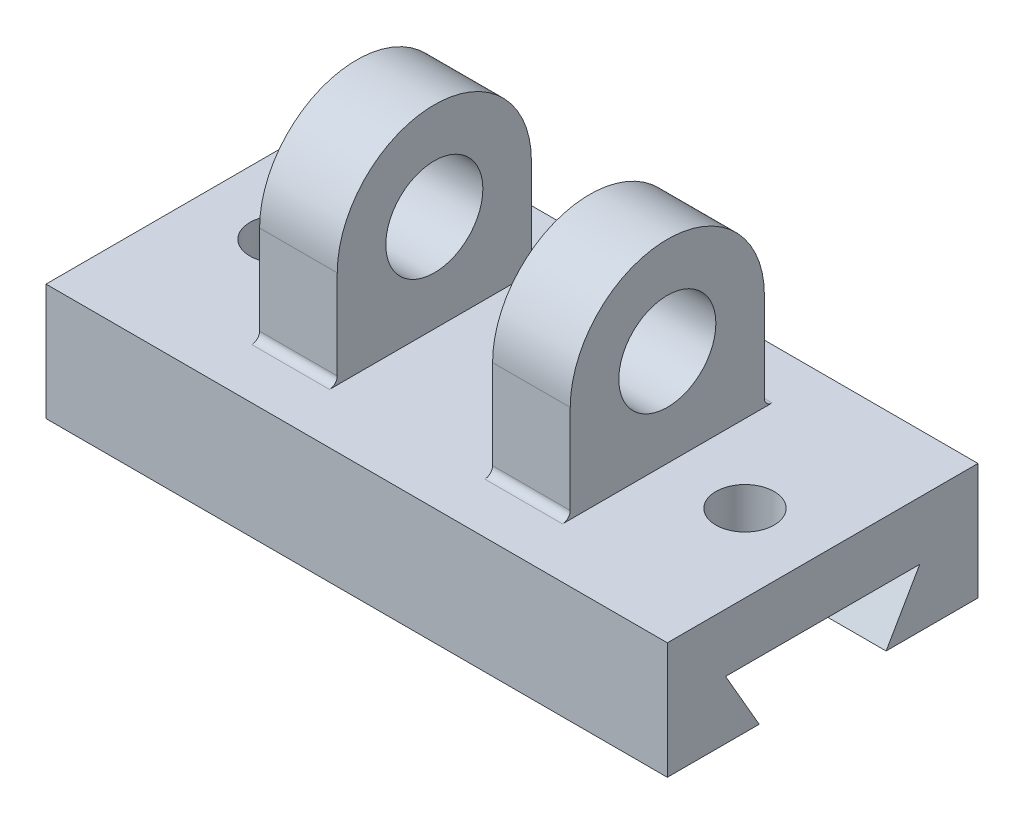
ISO-10303-21;
HEADER;
FILE_DESCRIPTION(('STEP AP214'),'2;1');
FILE_NAME('part.step','',(''),(''),'','','');
FILE_SCHEMA(('AUTOMOTIVE_DESIGN { 1 0 10303 214 1 1 1 1 }'));
ENDSEC;
DATA;
#1=APPLICATION_CONTEXT('core data for automotive mechanical design processes');
#2=APPLICATION_PROTOCOL_DEFINITION('international standard','automotive_design',2000,#1);
#3=PRODUCT_CONTEXT('',#1,'mechanical');
#4=PRODUCT('Part','Part','',(#3));
#5=PRODUCT_RELATED_PRODUCT_CATEGORY('part','',(#4));
#6=PRODUCT_DEFINITION_FORMATION('','',#4);
#7=PRODUCT_DEFINITION_CONTEXT('part definition',#1,'design');
#8=PRODUCT_DEFINITION('design','',#6,#7);
#9=PRODUCT_DEFINITION_SHAPE('','',#8);
#10=(LENGTH_UNIT() NAMED_UNIT(*) SI_UNIT(.MILLI.,.METRE.));
#11=(NAMED_UNIT(*) PLANE_ANGLE_UNIT() SI_UNIT($,.RADIAN.));
#12=(NAMED_UNIT(*) SI_UNIT($,.STERADIAN.) SOLID_ANGLE_UNIT());
#13=UNCERTAINTY_MEASURE_WITH_UNIT(LENGTH_MEASURE(1.E-05),#10,'distance_accuracy_value','');
#14=(GEOMETRIC_REPRESENTATION_CONTEXT(3) GLOBAL_UNCERTAINTY_ASSIGNED_CONTEXT((#13)) GLOBAL_UNIT_ASSIGNED_CONTEXT((#10,
#11,#12)) REPRESENTATION_CONTEXT('',''));
#15=CARTESIAN_POINT('',(0.,0.,0.));
#16=DIRECTION('',(0.,0.,1.));
#17=DIRECTION('',(1.,0.,0.));
#18=AXIS2_PLACEMENT_3D('',#15,#16,#17);
#19=CARTESIAN_POINT('',(0.,30.,0.));
#20=DIRECTION('',(0.,1.,0.));
#21=DIRECTION('',(0.,0.,1.));
#22=AXIS2_PLACEMENT_3D('',#19,#20,#21);
#23=PLANE('',#22);
#24=CARTESIAN_POINT('',(-60.,30.,0.));
#25=DIRECTION('',(0.,-1.,0.));
#26=DIRECTION('',(0.,0.,1.));
#27=AXIS2_PLACEMENT_3D('',#24,#25,#26);
#28=CIRCLE('',#27,7.50000000000001);
#29=CARTESIAN_POINT('',(-60.,30.,7.50000000000001));
#30=VERTEX_POINT('',#29);
#31=EDGE_CURVE('E231',#30,#30,#28,.T.);
#32=ORIENTED_EDGE('',*,*,#31,.T.);
#33=EDGE_LOOP('',(#32));
#34=FACE_BOUND('',#33,.T.);
#35=CARTESIAN_POINT('',(60.,30.,0.));
#36=DIRECTION('',(0.,1.,0.));
#37=DIRECTION('',(0.,0.,1.));
#38=AXIS2_PLACEMENT_3D('',#35,#36,#37);
#39=CIRCLE('',#38,7.50000000000001);
#40=CARTESIAN_POINT('',(60.,30.,7.50000000000001));
#41=VERTEX_POINT('',#40);
#42=EDGE_CURVE('E279',#41,#41,#39,.T.);
#43=ORIENTED_EDGE('',*,*,#42,.F.);
#44=EDGE_LOOP('',(#43));
#45=FACE_BOUND('',#44,.T.);
#46=DIRECTION('',(0.,0.,-1.));
#47=VECTOR('',#46,1.);
#48=CARTESIAN_POINT('',(80.,30.,-40.));
#49=LINE('',#48,#47);
#50=CARTESIAN_POINT('',(80.,30.,40.));
#51=VERTEX_POINT('',#50);
#52=CARTESIAN_POINT('',(80.,30.,-40.));
#53=VERTEX_POINT('',#52);
#54=EDGE_CURVE('E321',#51,#53,#49,.T.);
#55=ORIENTED_EDGE('',*,*,#54,.T.);
#56=DIRECTION('',(-1.,0.,0.));
#57=VECTOR('',#56,1.);
#58=CARTESIAN_POINT('',(-80.,30.,-40.));
#59=LINE('',#58,#57);
#60=CARTESIAN_POINT('',(-80.,30.,-40.));
#61=VERTEX_POINT('',#60);
#62=EDGE_CURVE('E325',#53,#61,#59,.T.);
#63=ORIENTED_EDGE('',*,*,#62,.T.);
#64=DIRECTION('',(0.,0.,1.));
#65=VECTOR('',#64,1.);
#66=CARTESIAN_POINT('',(-80.,30.,-40.));
#67=LINE('',#66,#65);
#68=CARTESIAN_POINT('',(-80.,30.,40.));
#69=VERTEX_POINT('',#68);
#70=EDGE_CURVE('E329',#61,#69,#67,.T.);
#71=ORIENTED_EDGE('',*,*,#70,.T.);
#72=DIRECTION('',(1.,0.,0.));
#73=VECTOR('',#72,1.);
#74=CARTESIAN_POINT('',(-80.,30.,40.));
#75=LINE('',#74,#73);
#76=EDGE_CURVE('E332',#69,#51,#75,.T.);
#77=ORIENTED_EDGE('',*,*,#76,.T.);
#78=EDGE_LOOP('',(#55,#63,#71,#77));
#79=FACE_BOUND('',#78,.T.);
#80=DIRECTION('',(1.,0.,0.));
#81=VECTOR('',#80,1.);
#82=CARTESIAN_POINT('',(0.,30.,-27.));
#83=LINE('',#82,#81);
#84=CARTESIAN_POINT('',(20.,30.,-27.));
#85=VERTEX_POINT('',#84);
#86=CARTESIAN_POINT('',(40.,30.,-27.));
#87=VERTEX_POINT('',#86);
#88=EDGE_CURVE('E382',#85,#87,#83,.T.);
#89=ORIENTED_EDGE('',*,*,#88,.T.);
#90=DIRECTION('',(0.,0.,1.));
#91=VECTOR('',#90,1.);
#92=CARTESIAN_POINT('',(40.,30.,0.));
#93=LINE('',#92,#91);
#94=CARTESIAN_POINT('',(40.,30.,27.));
#95=VERTEX_POINT('',#94);
#96=EDGE_CURVE('E270',#87,#95,#93,.T.);
#97=ORIENTED_EDGE('',*,*,#96,.T.);
#98=DIRECTION('',(1.,0.,0.));
#99=VECTOR('',#98,1.);
#100=CARTESIAN_POINT('',(20.,30.,27.));
#101=LINE('',#100,#99);
#102=CARTESIAN_POINT('',(20.,30.,27.));
#103=VERTEX_POINT('',#102);
#104=EDGE_CURVE('E378',#95,#103,#101,.F.);
#105=ORIENTED_EDGE('',*,*,#104,.T.);
#106=DIRECTION('',(0.,0.,1.));
#107=VECTOR('',#106,1.);
#108=CARTESIAN_POINT('',(20.,30.,0.));
#109=LINE('',#108,#107);
#110=EDGE_CURVE('E250',#85,#103,#109,.T.);
#111=ORIENTED_EDGE('',*,*,#110,.F.);
#112=EDGE_LOOP('',(#89,#97,#105,#111));
#113=FACE_BOUND('',#112,.T.);
#114=DIRECTION('',(0.,0.,1.));
#115=VECTOR('',#114,1.);
#116=CARTESIAN_POINT('',(-40.,30.,0.));
#117=LINE('',#116,#115);
#118=CARTESIAN_POINT('',(-40.,30.,-27.));
#119=VERTEX_POINT('',#118);
#120=CARTESIAN_POINT('',(-40.,30.,27.));
#121=VERTEX_POINT('',#120);
#122=EDGE_CURVE('E224',#119,#121,#117,.T.);
#123=ORIENTED_EDGE('',*,*,#122,.F.);
#124=DIRECTION('',(-1.,0.,0.));
#125=VECTOR('',#124,1.);
#126=CARTESIAN_POINT('',(-20.,30.,-27.));
#127=LINE('',#126,#125);
#128=CARTESIAN_POINT('',(-20.,30.,-27.));
#129=VERTEX_POINT('',#128);
#130=EDGE_CURVE('E386',#119,#129,#127,.F.);
#131=ORIENTED_EDGE('',*,*,#130,.T.);
#132=DIRECTION('',(0.,0.,1.));
#133=VECTOR('',#132,1.);
#134=CARTESIAN_POINT('',(-20.,30.,0.));
#135=LINE('',#134,#133);
#136=CARTESIAN_POINT('',(-20.,30.,27.));
#137=VERTEX_POINT('',#136);
#138=EDGE_CURVE('E207',#129,#137,#135,.T.);
#139=ORIENTED_EDGE('',*,*,#138,.T.);
#140=DIRECTION('',(-1.,0.,0.));
#141=VECTOR('',#140,1.);
#142=CARTESIAN_POINT('',(0.,30.,27.));
#143=LINE('',#142,#141);
#144=EDGE_CURVE('E374',#137,#121,#143,.T.);
#145=ORIENTED_EDGE('',*,*,#144,.T.);
#146=EDGE_LOOP('',(#123,#131,#139,#145));
#147=FACE_BOUND('',#146,.T.);
#148=ADVANCED_FACE('F41',(#34,#45,#79,#113,#147),#23,.T.);
#149=CARTESIAN_POINT('',(80.,30.,-40.));
#150=DIRECTION('',(-1.,0.,0.));
#151=DIRECTION('',(0.,0.,1.));
#152=AXIS2_PLACEMENT_3D('',#149,#150,#151);
#153=PLANE('',#152);
#154=DIRECTION('',(0.,-0.866025403784436,0.500000000000004));
#155=VECTOR('',#154,1.);
#156=CARTESIAN_POINT('',(80.,-7.07531754730548,-12.2548094716166));
#157=LINE('',#156,#155);
#158=CARTESIAN_POINT('',(80.,15.,-25.));
#159=VERTEX_POINT('',#158);
#160=CARTESIAN_POINT('',(80.,0.,-16.3397459621555));
#161=VERTEX_POINT('',#160);
#162=EDGE_CURVE('E297',#159,#161,#157,.T.);
#163=ORIENTED_EDGE('',*,*,#162,.T.);
#164=DIRECTION('',(0.,0.,-1.));
#165=VECTOR('',#164,1.);
#166=CARTESIAN_POINT('',(80.,0.,-40.));
#167=LINE('',#166,#165);
#168=CARTESIAN_POINT('',(80.,0.,-40.));
#169=VERTEX_POINT('',#168);
#170=EDGE_CURVE('E311',#161,#169,#167,.T.);
#171=ORIENTED_EDGE('',*,*,#170,.T.);
#172=DIRECTION('',(0.,-1.,0.));
#173=VECTOR('',#172,1.);
#174=CARTESIAN_POINT('',(80.,30.,-40.));
#175=LINE('',#174,#173);
#176=EDGE_CURVE('E361',#53,#169,#175,.T.);
#177=ORIENTED_EDGE('',*,*,#176,.F.);
#178=ORIENTED_EDGE('',*,*,#54,.F.);
#179=DIRECTION('',(0.,-1.,0.));
#180=VECTOR('',#179,1.);
#181=CARTESIAN_POINT('',(80.,30.,40.));
#182=LINE('',#181,#180);
#183=CARTESIAN_POINT('',(80.,0.,40.));
#184=VERTEX_POINT('',#183);
#185=EDGE_CURVE('E335',#51,#184,#182,.T.);
#186=ORIENTED_EDGE('',*,*,#185,.T.);
#187=CARTESIAN_POINT('',(80.,0.,16.3397459621555));
#188=VERTEX_POINT('',#187);
#189=EDGE_CURVE('E336',#184,#188,#167,.T.);
#190=ORIENTED_EDGE('',*,*,#189,.T.);
#191=DIRECTION('',(0.,0.866025403784436,0.500000000000004));
#192=VECTOR('',#191,1.);
#193=CARTESIAN_POINT('',(80.,-7.07531754730548,12.2548094716166));
#194=LINE('',#193,#192);
#195=CARTESIAN_POINT('',(80.,15.,25.));
#196=VERTEX_POINT('',#195);
#197=EDGE_CURVE('E290',#188,#196,#194,.T.);
#198=ORIENTED_EDGE('',*,*,#197,.T.);
#199=DIRECTION('',(0.,0.,-1.));
#200=VECTOR('',#199,1.);
#201=CARTESIAN_POINT('',(80.,15.,0.));
#202=LINE('',#201,#200);
#203=EDGE_CURVE('E301',#196,#159,#202,.T.);
#204=ORIENTED_EDGE('',*,*,#203,.T.);
#205=EDGE_LOOP('',(#163,#171,#177,#178,#186,#190,#198,#204));
#206=FACE_BOUND('',#205,.T.);
#207=ADVANCED_FACE('F425',(#206),#153,.F.);
#208=CARTESIAN_POINT('',(-80.,30.,-40.));
#209=DIRECTION('',(1.,0.,0.));
#210=DIRECTION('',(0.,0.,-1.));
#211=AXIS2_PLACEMENT_3D('',#208,#209,#210);
#212=PLANE('',#211);
#213=DIRECTION('',(0.,-0.866025403784436,0.500000000000004));
#214=VECTOR('',#213,1.);
#215=CARTESIAN_POINT('',(-80.,-7.07531754730548,-12.2548094716166));
#216=LINE('',#215,#214);
#217=CARTESIAN_POINT('',(-80.,15.,-25.));
#218=VERTEX_POINT('',#217);
#219=CARTESIAN_POINT('',(-80.,0.,-16.3397459621555));
#220=VERTEX_POINT('',#219);
#221=EDGE_CURVE('E286',#218,#220,#216,.T.);
#222=ORIENTED_EDGE('',*,*,#221,.F.);
#223=DIRECTION('',(0.,0.,-1.));
#224=VECTOR('',#223,1.);
#225=CARTESIAN_POINT('',(-80.,15.,0.));
#226=LINE('',#225,#224);
#227=CARTESIAN_POINT('',(-80.,15.,25.));
#228=VERTEX_POINT('',#227);
#229=EDGE_CURVE('E289',#228,#218,#226,.T.);
#230=ORIENTED_EDGE('',*,*,#229,.F.);
#231=DIRECTION('',(0.,0.866025403784436,0.500000000000004));
#232=VECTOR('',#231,1.);
#233=CARTESIAN_POINT('',(-80.,-7.07531754730548,12.2548094716166));
#234=LINE('',#233,#232);
#235=CARTESIAN_POINT('',(-80.,0.,16.3397459621555));
#236=VERTEX_POINT('',#235);
#237=EDGE_CURVE('E293',#236,#228,#234,.T.);
#238=ORIENTED_EDGE('',*,*,#237,.F.);
#239=DIRECTION('',(0.,0.,1.));
#240=VECTOR('',#239,1.);
#241=CARTESIAN_POINT('',(-80.,0.,-40.));
#242=LINE('',#241,#240);
#243=CARTESIAN_POINT('',(-80.,0.,40.));
#244=VERTEX_POINT('',#243);
#245=EDGE_CURVE('E343',#236,#244,#242,.T.);
#246=ORIENTED_EDGE('',*,*,#245,.T.);
#247=DIRECTION('',(0.,-1.,0.));
#248=VECTOR('',#247,1.);
#249=CARTESIAN_POINT('',(-80.,30.,40.));
#250=LINE('',#249,#248);
#251=EDGE_CURVE('E353',#69,#244,#250,.T.);
#252=ORIENTED_EDGE('',*,*,#251,.F.);
#253=ORIENTED_EDGE('',*,*,#70,.F.);
#254=DIRECTION('',(0.,-1.,0.));
#255=VECTOR('',#254,1.);
#256=CARTESIAN_POINT('',(-80.,30.,-40.));
#257=LINE('',#256,#255);
#258=CARTESIAN_POINT('',(-80.,0.,-40.));
#259=VERTEX_POINT('',#258);
#260=EDGE_CURVE('E357',#61,#259,#257,.T.);
#261=ORIENTED_EDGE('',*,*,#260,.T.);
#262=EDGE_CURVE('E344',#259,#220,#242,.T.);
#263=ORIENTED_EDGE('',*,*,#262,.T.);
#264=EDGE_LOOP('',(#222,#230,#238,#246,#252,#253,#261,#263));
#265=FACE_BOUND('',#264,.T.);
#266=ADVANCED_FACE('F453',(#265),#212,.F.);
#267=CARTESIAN_POINT('',(0.,0.,0.));
#268=DIRECTION('',(0.,1.,0.));
#269=DIRECTION('',(0.,0.,1.));
#270=AXIS2_PLACEMENT_3D('',#267,#268,#269);
#271=PLANE('',#270);
#272=DIRECTION('',(1.,0.,0.));
#273=VECTOR('',#272,1.);
#274=CARTESIAN_POINT('',(-80.,0.,-16.3397459621555));
#275=LINE('',#274,#273);
#276=EDGE_CURVE('E308',#220,#161,#275,.T.);
#277=ORIENTED_EDGE('',*,*,#276,.F.);
#278=ORIENTED_EDGE('',*,*,#262,.F.);
#279=DIRECTION('',(-1.,0.,0.));
#280=VECTOR('',#279,1.);
#281=CARTESIAN_POINT('',(-80.,0.,-40.));
#282=LINE('',#281,#280);
#283=EDGE_CURVE('E340',#169,#259,#282,.T.);
#284=ORIENTED_EDGE('',*,*,#283,.F.);
#285=ORIENTED_EDGE('',*,*,#170,.F.);
#286=EDGE_LOOP('',(#277,#278,#284,#285));
#287=FACE_BOUND('',#286,.T.);
#288=ADVANCED_FACE('F431',(#287),#271,.F.);
#289=DIRECTION('',(1.,0.,0.));
#290=VECTOR('',#289,1.);
#291=CARTESIAN_POINT('',(-80.,0.,16.3397459621555));
#292=LINE('',#291,#290);
#293=EDGE_CURVE('E312',#236,#188,#292,.T.);
#294=ORIENTED_EDGE('',*,*,#293,.T.);
#295=ORIENTED_EDGE('',*,*,#189,.F.);
#296=DIRECTION('',(1.,0.,0.));
#297=VECTOR('',#296,1.);
#298=CARTESIAN_POINT('',(-80.,0.,40.));
#299=LINE('',#298,#297);
#300=EDGE_CURVE('E326',#244,#184,#299,.T.);
#301=ORIENTED_EDGE('',*,*,#300,.F.);
#302=ORIENTED_EDGE('',*,*,#245,.F.);
#303=EDGE_LOOP('',(#294,#295,#301,#302));
#304=FACE_BOUND('',#303,.T.);
#305=ADVANCED_FACE('F444',(#304),#271,.F.);
#306=CARTESIAN_POINT('',(-80.,30.,-40.));
#307=DIRECTION('',(0.,0.,1.));
#308=DIRECTION('',(1.,0.,0.));
#309=AXIS2_PLACEMENT_3D('',#306,#307,#308);
#310=PLANE('',#309);
#311=ORIENTED_EDGE('',*,*,#283,.T.);
#312=ORIENTED_EDGE('',*,*,#260,.F.);
#313=ORIENTED_EDGE('',*,*,#62,.F.);
#314=ORIENTED_EDGE('',*,*,#176,.T.);
#315=EDGE_LOOP('',(#311,#312,#313,#314));
#316=FACE_BOUND('',#315,.T.);
#317=ADVANCED_FACE('F434',(#316),#310,.F.);
#318=CARTESIAN_POINT('',(-80.,30.,40.));
#319=DIRECTION('',(0.,0.,-1.));
#320=DIRECTION('',(-1.,0.,0.));
#321=AXIS2_PLACEMENT_3D('',#318,#319,#320);
#322=PLANE('',#321);
#323=ORIENTED_EDGE('',*,*,#300,.T.);
#324=ORIENTED_EDGE('',*,*,#185,.F.);
#325=ORIENTED_EDGE('',*,*,#76,.F.);
#326=ORIENTED_EDGE('',*,*,#251,.T.);
#327=EDGE_LOOP('',(#323,#324,#325,#326));
#328=FACE_BOUND('',#327,.T.);
#329=ADVANCED_FACE('F461',(#328),#322,.F.);
#330=CARTESIAN_POINT('',(-80.,-7.07531754730548,-12.2548094716166));
#331=DIRECTION('',(0.,0.500000000000004,0.866025403784436));
#332=DIRECTION('',(0.,-0.866025403784436,0.500000000000004));
#333=AXIS2_PLACEMENT_3D('',#330,#331,#332);
#334=PLANE('',#333);
#335=ORIENTED_EDGE('',*,*,#162,.F.);
#336=DIRECTION('',(1.,0.,0.));
#337=VECTOR('',#336,1.);
#338=CARTESIAN_POINT('',(-80.,15.,-25.));
#339=LINE('',#338,#337);
#340=EDGE_CURVE('E296',#218,#159,#339,.T.);
#341=ORIENTED_EDGE('',*,*,#340,.F.);
#342=ORIENTED_EDGE('',*,*,#221,.T.);
#343=ORIENTED_EDGE('',*,*,#276,.T.);
#344=EDGE_LOOP('',(#335,#341,#342,#343));
#345=FACE_BOUND('',#344,.T.);
#346=ADVANCED_FACE('F460',(#345),#334,.T.);
#347=CARTESIAN_POINT('',(-80.,-7.07531754730548,12.2548094716166));
#348=DIRECTION('',(0.,0.500000000000004,-0.866025403784436));
#349=DIRECTION('',(0.,0.866025403784436,0.500000000000004));
#350=AXIS2_PLACEMENT_3D('',#347,#348,#349);
#351=PLANE('',#350);
#352=ORIENTED_EDGE('',*,*,#197,.F.);
#353=ORIENTED_EDGE('',*,*,#293,.F.);
#354=ORIENTED_EDGE('',*,*,#237,.T.);
#355=DIRECTION('',(1.,0.,0.));
#356=VECTOR('',#355,1.);
#357=CARTESIAN_POINT('',(-80.,15.,25.));
#358=LINE('',#357,#356);
#359=EDGE_CURVE('E316',#228,#196,#358,.T.);
#360=ORIENTED_EDGE('',*,*,#359,.T.);
#361=EDGE_LOOP('',(#352,#353,#354,#360));
#362=FACE_BOUND('',#361,.T.);
#363=ADVANCED_FACE('F448',(#362),#351,.T.);
#364=CARTESIAN_POINT('',(-80.,15.,0.));
#365=DIRECTION('',(0.,-1.,0.));
#366=DIRECTION('',(0.,0.,-1.));
#367=AXIS2_PLACEMENT_3D('',#364,#365,#366);
#368=PLANE('',#367);
#369=CARTESIAN_POINT('',(-60.,15.,0.));
#370=DIRECTION('',(0.,-1.,0.));
#371=DIRECTION('',(0.,0.,-1.));
#372=AXIS2_PLACEMENT_3D('',#369,#370,#371);
#373=CIRCLE('',#372,7.50000000000001);
#374=CARTESIAN_POINT('',(-60.,15.,-7.50000000000001));
#375=VERTEX_POINT('',#374);
#376=EDGE_CURVE('E236',#375,#375,#373,.F.);
#377=ORIENTED_EDGE('',*,*,#376,.T.);
#378=EDGE_LOOP('',(#377));
#379=FACE_BOUND('',#378,.T.);
#380=CARTESIAN_POINT('',(60.,15.,0.));
#381=DIRECTION('',(0.,-1.,0.));
#382=DIRECTION('',(0.,0.,-1.));
#383=AXIS2_PLACEMENT_3D('',#380,#381,#382);
#384=CIRCLE('',#383,7.50000000000001);
#385=CARTESIAN_POINT('',(60.,15.,-7.50000000000001));
#386=VERTEX_POINT('',#385);
#387=EDGE_CURVE('E285',#386,#386,#384,.T.);
#388=ORIENTED_EDGE('',*,*,#387,.F.);
#389=EDGE_LOOP('',(#388));
#390=FACE_BOUND('',#389,.T.);
#391=ORIENTED_EDGE('',*,*,#203,.F.);
#392=ORIENTED_EDGE('',*,*,#359,.F.);
#393=ORIENTED_EDGE('',*,*,#229,.T.);
#394=ORIENTED_EDGE('',*,*,#340,.T.);
#395=EDGE_LOOP('',(#391,#392,#393,#394));
#396=FACE_BOUND('',#395,.T.);
#397=ADVANCED_FACE('F458',(#379,#390,#396),#368,.T.);
#398=CARTESIAN_POINT('',(60.,0.,0.));
#399=DIRECTION('',(0.,1.,0.));
#400=DIRECTION('',(0.,0.,1.));
#401=AXIS2_PLACEMENT_3D('',#398,#399,#400);
#402=CYLINDRICAL_SURFACE('',#401,7.50000000000001);
#403=ORIENTED_EDGE('',*,*,#387,.T.);
#404=EDGE_LOOP('',(#403));
#405=FACE_BOUND('',#404,.T.);
#406=ORIENTED_EDGE('',*,*,#42,.T.);
#407=EDGE_LOOP('',(#406));
#408=FACE_BOUND('',#407,.T.);
#409=ADVANCED_FACE('F537',(#405,#408),#402,.F.);
#410=CARTESIAN_POINT('',(20.,55.,0.));
#411=DIRECTION('',(1.,0.,0.));
#412=DIRECTION('',(0.,0.,-1.));
#413=AXIS2_PLACEMENT_3D('',#410,#411,#412);
#414=CYLINDRICAL_SURFACE('',#413,25.);
#415=CARTESIAN_POINT('',(40.,55.,0.));
#416=DIRECTION('',(1.,0.,0.));
#417=DIRECTION('',(0.,0.,-1.));
#418=AXIS2_PLACEMENT_3D('',#415,#416,#417);
#419=CIRCLE('',#418,25.);
#420=CARTESIAN_POINT('',(40.,55.,-25.));
#421=VERTEX_POINT('',#420);
#422=CARTESIAN_POINT('',(40.,55.,25.));
#423=VERTEX_POINT('',#422);
#424=EDGE_CURVE('E262',#421,#423,#419,.T.);
#425=ORIENTED_EDGE('',*,*,#424,.F.);
#426=DIRECTION('',(1.,0.,0.));
#427=VECTOR('',#426,1.);
#428=CARTESIAN_POINT('',(20.,55.,-25.));
#429=LINE('',#428,#427);
#430=CARTESIAN_POINT('',(20.,55.,-25.));
#431=VERTEX_POINT('',#430);
#432=EDGE_CURVE('E276',#431,#421,#429,.T.);
#433=ORIENTED_EDGE('',*,*,#432,.F.);
#434=CARTESIAN_POINT('',(20.,55.,0.));
#435=DIRECTION('',(1.,0.,0.));
#436=DIRECTION('',(0.,0.,-1.));
#437=AXIS2_PLACEMENT_3D('',#434,#435,#436);
#438=CIRCLE('',#437,25.);
#439=CARTESIAN_POINT('',(20.,55.,25.));
#440=VERTEX_POINT('',#439);
#441=EDGE_CURVE('E241',#431,#440,#438,.T.);
#442=ORIENTED_EDGE('',*,*,#441,.T.);
#443=DIRECTION('',(1.,0.,0.));
#444=VECTOR('',#443,1.);
#445=CARTESIAN_POINT('',(20.,55.,25.));
#446=LINE('',#445,#444);
#447=EDGE_CURVE('E257',#440,#423,#446,.T.);
#448=ORIENTED_EDGE('',*,*,#447,.T.);
#449=EDGE_LOOP('',(#425,#433,#442,#448));
#450=FACE_BOUND('',#449,.T.);
#451=ADVANCED_FACE('F516',(#450),#414,.T.);
#452=CARTESIAN_POINT('',(20.,0.,-25.));
#453=DIRECTION('',(0.,0.,1.));
#454=DIRECTION('',(0.,-1.,0.));
#455=AXIS2_PLACEMENT_3D('',#452,#453,#454);
#456=PLANE('',#455);
#457=DIRECTION('',(0.,-1.,0.));
#458=VECTOR('',#457,1.);
#459=CARTESIAN_POINT('',(40.,0.,-25.));
#460=LINE('',#459,#458);
#461=CARTESIAN_POINT('',(40.,32.,-25.));
#462=VERTEX_POINT('',#461);
#463=EDGE_CURVE('E242',#421,#462,#460,.T.);
#464=ORIENTED_EDGE('',*,*,#463,.T.);
#465=DIRECTION('',(1.,0.,0.));
#466=VECTOR('',#465,1.);
#467=CARTESIAN_POINT('',(20.,32.,-25.));
#468=LINE('',#467,#466);
#469=CARTESIAN_POINT('',(20.,32.,-25.));
#470=VERTEX_POINT('',#469);
#471=EDGE_CURVE('E390',#462,#470,#468,.F.);
#472=ORIENTED_EDGE('',*,*,#471,.T.);
#473=DIRECTION('',(0.,-1.,0.));
#474=VECTOR('',#473,1.);
#475=CARTESIAN_POINT('',(20.,0.,-25.));
#476=LINE('',#475,#474);
#477=EDGE_CURVE('E253',#431,#470,#476,.T.);
#478=ORIENTED_EDGE('',*,*,#477,.F.);
#479=ORIENTED_EDGE('',*,*,#432,.T.);
#480=EDGE_LOOP('',(#464,#472,#478,#479));
#481=FACE_BOUND('',#480,.T.);
#482=ADVANCED_FACE('F527',(#481),#456,.F.);
#483=CARTESIAN_POINT('',(20.,55.,0.));
#484=DIRECTION('',(1.,0.,0.));
#485=DIRECTION('',(0.,0.,-1.));
#486=AXIS2_PLACEMENT_3D('',#483,#484,#485);
#487=CYLINDRICAL_SURFACE('',#486,12.5);
#488=CARTESIAN_POINT('',(20.,55.,0.));
#489=DIRECTION('',(1.,0.,0.));
#490=DIRECTION('',(0.,0.,-1.));
#491=AXIS2_PLACEMENT_3D('',#488,#489,#490);
#492=CIRCLE('',#491,12.5);
#493=CARTESIAN_POINT('',(20.,55.,-12.5));
#494=VERTEX_POINT('',#493);
#495=EDGE_CURVE('E237',#494,#494,#492,.T.);
#496=ORIENTED_EDGE('',*,*,#495,.F.);
#497=EDGE_LOOP('',(#496));
#498=FACE_BOUND('',#497,.T.);
#499=CARTESIAN_POINT('',(40.,55.,0.));
#500=DIRECTION('',(1.,0.,0.));
#501=DIRECTION('',(0.,0.,-1.));
#502=AXIS2_PLACEMENT_3D('',#499,#500,#501);
#503=CIRCLE('',#502,12.5);
#504=CARTESIAN_POINT('',(40.,55.,-12.5));
#505=VERTEX_POINT('',#504);
#506=EDGE_CURVE('E258',#505,#505,#503,.T.);
#507=ORIENTED_EDGE('',*,*,#506,.T.);
#508=EDGE_LOOP('',(#507));
#509=FACE_BOUND('',#508,.T.);
#510=ADVANCED_FACE('F529',(#498,#509),#487,.F.);
#511=CARTESIAN_POINT('',(20.,0.,25.));
#512=DIRECTION('',(0.,0.,1.));
#513=DIRECTION('',(0.,-1.,0.));
#514=AXIS2_PLACEMENT_3D('',#511,#512,#513);
#515=PLANE('',#514);
#516=DIRECTION('',(0.,-1.,0.));
#517=VECTOR('',#516,1.);
#518=CARTESIAN_POINT('',(20.,0.,25.));
#519=LINE('',#518,#517);
#520=CARTESIAN_POINT('',(20.,32.,25.));
#521=VERTEX_POINT('',#520);
#522=EDGE_CURVE('E246',#440,#521,#519,.T.);
#523=ORIENTED_EDGE('',*,*,#522,.T.);
#524=DIRECTION('',(1.,0.,0.));
#525=VECTOR('',#524,1.);
#526=CARTESIAN_POINT('',(40.,32.,25.));
#527=LINE('',#526,#525);
#528=CARTESIAN_POINT('',(40.,32.,25.));
#529=VERTEX_POINT('',#528);
#530=EDGE_CURVE('E393',#521,#529,#527,.T.);
#531=ORIENTED_EDGE('',*,*,#530,.T.);
#532=DIRECTION('',(0.,-1.,0.));
#533=VECTOR('',#532,1.);
#534=CARTESIAN_POINT('',(40.,0.,25.));
#535=LINE('',#534,#533);
#536=EDGE_CURVE('E266',#423,#529,#535,.T.);
#537=ORIENTED_EDGE('',*,*,#536,.F.);
#538=ORIENTED_EDGE('',*,*,#447,.F.);
#539=EDGE_LOOP('',(#523,#531,#537,#538));
#540=FACE_BOUND('',#539,.T.);
#541=ADVANCED_FACE('F512',(#540),#515,.T.);
#542=CARTESIAN_POINT('',(20.,0.,0.));
#543=DIRECTION('',(1.,0.,0.));
#544=DIRECTION('',(0.,0.,-1.));
#545=AXIS2_PLACEMENT_3D('',#542,#543,#544);
#546=PLANE('',#545);
#547=ORIENTED_EDGE('',*,*,#495,.T.);
#548=EDGE_LOOP('',(#547));
#549=FACE_BOUND('',#548,.T.);
#550=ORIENTED_EDGE('',*,*,#441,.F.);
#551=ORIENTED_EDGE('',*,*,#477,.T.);
#552=CARTESIAN_POINT('',(20.,32.,-27.));
#553=DIRECTION('',(1.,0.,0.));
#554=DIRECTION('',(0.,0.,-1.));
#555=AXIS2_PLACEMENT_3D('',#552,#553,#554);
#556=CIRCLE('',#555,2.);
#557=EDGE_CURVE('E408',#470,#85,#556,.T.);
#558=ORIENTED_EDGE('',*,*,#557,.T.);
#559=ORIENTED_EDGE('',*,*,#110,.T.);
#560=CARTESIAN_POINT('',(20.,32.,27.));
#561=DIRECTION('',(1.,0.,0.));
#562=DIRECTION('',(0.,0.,-1.));
#563=AXIS2_PLACEMENT_3D('',#560,#561,#562);
#564=CIRCLE('',#563,2.);
#565=EDGE_CURVE('E416',#103,#521,#564,.T.);
#566=ORIENTED_EDGE('',*,*,#565,.T.);
#567=ORIENTED_EDGE('',*,*,#522,.F.);
#568=EDGE_LOOP('',(#550,#551,#558,#559,#566,#567));
#569=FACE_BOUND('',#568,.T.);
#570=ADVANCED_FACE('F510',(#549,#569),#546,.F.);
#571=CARTESIAN_POINT('',(40.,0.,0.));
#572=DIRECTION('',(1.,0.,0.));
#573=DIRECTION('',(0.,0.,-1.));
#574=AXIS2_PLACEMENT_3D('',#571,#572,#573);
#575=PLANE('',#574);
#576=ORIENTED_EDGE('',*,*,#506,.F.);
#577=EDGE_LOOP('',(#576));
#578=FACE_BOUND('',#577,.T.);
#579=ORIENTED_EDGE('',*,*,#424,.T.);
#580=ORIENTED_EDGE('',*,*,#536,.T.);
#581=CARTESIAN_POINT('',(40.,32.,27.));
#582=DIRECTION('',(1.,0.,0.));
#583=DIRECTION('',(0.,0.,-1.));
#584=AXIS2_PLACEMENT_3D('',#581,#582,#583);
#585=CIRCLE('',#584,2.);
#586=EDGE_CURVE('E412',#529,#95,#585,.F.);
#587=ORIENTED_EDGE('',*,*,#586,.T.);
#588=ORIENTED_EDGE('',*,*,#96,.F.);
#589=CARTESIAN_POINT('',(40.,32.,-27.));
#590=DIRECTION('',(1.,0.,0.));
#591=DIRECTION('',(0.,0.,-1.));
#592=AXIS2_PLACEMENT_3D('',#589,#590,#591);
#593=CIRCLE('',#592,2.);
#594=EDGE_CURVE('E405',#87,#462,#593,.F.);
#595=ORIENTED_EDGE('',*,*,#594,.T.);
#596=ORIENTED_EDGE('',*,*,#463,.F.);
#597=EDGE_LOOP('',(#579,#580,#587,#588,#595,#596));
#598=FACE_BOUND('',#597,.T.);
#599=ADVANCED_FACE('F525',(#578,#598),#575,.T.);
#600=CARTESIAN_POINT('',(-60.,0.,0.));
#601=DIRECTION('',(0.,1.,0.));
#602=DIRECTION('',(0.,0.,1.));
#603=AXIS2_PLACEMENT_3D('',#600,#601,#602);
#604=CYLINDRICAL_SURFACE('',#603,7.50000000000001);
#605=ORIENTED_EDGE('',*,*,#376,.F.);
#606=EDGE_LOOP('',(#605));
#607=FACE_BOUND('',#606,.T.);
#608=ORIENTED_EDGE('',*,*,#31,.F.);
#609=EDGE_LOOP('',(#608));
#610=FACE_BOUND('',#609,.T.);
#611=ADVANCED_FACE('F558',(#607,#610),#604,.F.);
#612=CARTESIAN_POINT('',(-20.,55.,0.));
#613=DIRECTION('',(-1.,0.,0.));
#614=DIRECTION('',(0.,0.,1.));
#615=AXIS2_PLACEMENT_3D('',#612,#613,#614);
#616=CYLINDRICAL_SURFACE('',#615,25.);
#617=CARTESIAN_POINT('',(-40.,55.,0.));
#618=DIRECTION('',(1.,0.,0.));
#619=DIRECTION('',(0.,0.,-1.));
#620=AXIS2_PLACEMENT_3D('',#617,#618,#619);
#621=CIRCLE('',#620,25.);
#622=CARTESIAN_POINT('',(-40.,55.,-25.));
#623=VERTEX_POINT('',#622);
#624=CARTESIAN_POINT('',(-40.,55.,25.));
#625=VERTEX_POINT('',#624);
#626=EDGE_CURVE('E219',#623,#625,#621,.T.);
#627=ORIENTED_EDGE('',*,*,#626,.T.);
#628=DIRECTION('',(-1.,0.,0.));
#629=VECTOR('',#628,1.);
#630=CARTESIAN_POINT('',(-20.,55.,25.));
#631=LINE('',#630,#629);
#632=CARTESIAN_POINT('',(-20.,55.,25.));
#633=VERTEX_POINT('',#632);
#634=EDGE_CURVE('E191',#633,#625,#631,.T.);
#635=ORIENTED_EDGE('',*,*,#634,.F.);
#636=CARTESIAN_POINT('',(-20.,55.,0.));
#637=DIRECTION('',(1.,0.,0.));
#638=DIRECTION('',(0.,0.,-1.));
#639=AXIS2_PLACEMENT_3D('',#636,#637,#638);
#640=CIRCLE('',#639,25.);
#641=CARTESIAN_POINT('',(-20.,55.,-25.));
#642=VERTEX_POINT('',#641);
#643=EDGE_CURVE('E196',#642,#633,#640,.T.);
#644=ORIENTED_EDGE('',*,*,#643,.F.);
#645=DIRECTION('',(-1.,0.,0.));
#646=VECTOR('',#645,1.);
#647=CARTESIAN_POINT('',(-20.,55.,-25.));
#648=LINE('',#647,#646);
#649=EDGE_CURVE('E178',#642,#623,#648,.T.);
#650=ORIENTED_EDGE('',*,*,#649,.T.);
#651=EDGE_LOOP('',(#627,#635,#644,#650));
#652=FACE_BOUND('',#651,.T.);
#653=ADVANCED_FACE('F197',(#652),#616,.T.);
#654=CARTESIAN_POINT('',(-20.,0.,25.));
#655=DIRECTION('',(0.,0.,-1.));
#656=DIRECTION('',(0.,1.,0.));
#657=AXIS2_PLACEMENT_3D('',#654,#655,#656);
#658=PLANE('',#657);
#659=DIRECTION('',(0.,-1.,0.));
#660=VECTOR('',#659,1.);
#661=CARTESIAN_POINT('',(-40.,0.,25.));
#662=LINE('',#661,#660);
#663=CARTESIAN_POINT('',(-40.,32.,25.));
#664=VERTEX_POINT('',#663);
#665=EDGE_CURVE('E227',#625,#664,#662,.T.);
#666=ORIENTED_EDGE('',*,*,#665,.T.);
#667=DIRECTION('',(-1.,0.,0.));
#668=VECTOR('',#667,1.);
#669=CARTESIAN_POINT('',(-20.,32.,25.));
#670=LINE('',#669,#668);
#671=CARTESIAN_POINT('',(-20.,32.,25.));
#672=VERTEX_POINT('',#671);
#673=EDGE_CURVE('E57',#664,#672,#670,.F.);
#674=ORIENTED_EDGE('',*,*,#673,.T.);
#675=DIRECTION('',(0.,-1.,0.));
#676=VECTOR('',#675,1.);
#677=CARTESIAN_POINT('',(-20.,0.,25.));
#678=LINE('',#677,#676);
#679=EDGE_CURVE('E192',#633,#672,#678,.T.);
#680=ORIENTED_EDGE('',*,*,#679,.F.);
#681=ORIENTED_EDGE('',*,*,#634,.T.);
#682=EDGE_LOOP('',(#666,#674,#680,#681));
#683=FACE_BOUND('',#682,.T.);
#684=ADVANCED_FACE('F567',(#683),#658,.F.);
#685=CARTESIAN_POINT('',(-20.,55.,0.));
#686=DIRECTION('',(-1.,0.,0.));
#687=DIRECTION('',(0.,0.,1.));
#688=AXIS2_PLACEMENT_3D('',#685,#686,#687);
#689=CYLINDRICAL_SURFACE('',#688,12.5);
#690=CARTESIAN_POINT('',(-20.,55.,0.));
#691=DIRECTION('',(1.,0.,0.));
#692=DIRECTION('',(0.,0.,-1.));
#693=AXIS2_PLACEMENT_3D('',#690,#691,#692);
#694=CIRCLE('',#693,12.5);
#695=CARTESIAN_POINT('',(-20.,55.,-12.5));
#696=VERTEX_POINT('',#695);
#697=EDGE_CURVE('E201',#696,#696,#694,.T.);
#698=ORIENTED_EDGE('',*,*,#697,.T.);
#699=EDGE_LOOP('',(#698));
#700=FACE_BOUND('',#699,.T.);
#701=CARTESIAN_POINT('',(-40.,55.,0.));
#702=DIRECTION('',(1.,0.,0.));
#703=DIRECTION('',(0.,0.,-1.));
#704=AXIS2_PLACEMENT_3D('',#701,#702,#703);
#705=CIRCLE('',#704,12.5);
#706=CARTESIAN_POINT('',(-40.,55.,-12.5));
#707=VERTEX_POINT('',#706);
#708=EDGE_CURVE('E215',#707,#707,#705,.T.);
#709=ORIENTED_EDGE('',*,*,#708,.F.);
#710=EDGE_LOOP('',(#709));
#711=FACE_BOUND('',#710,.T.);
#712=ADVANCED_FACE('F571',(#700,#711),#689,.F.);
#713=CARTESIAN_POINT('',(-20.,0.,-25.));
#714=DIRECTION('',(0.,0.,-1.));
#715=DIRECTION('',(0.,1.,0.));
#716=AXIS2_PLACEMENT_3D('',#713,#714,#715);
#717=PLANE('',#716);
#718=DIRECTION('',(0.,-1.,0.));
#719=VECTOR('',#718,1.);
#720=CARTESIAN_POINT('',(-20.,0.,-25.));
#721=LINE('',#720,#719);
#722=CARTESIAN_POINT('',(-20.,32.,-25.));
#723=VERTEX_POINT('',#722);
#724=EDGE_CURVE('E183',#642,#723,#721,.T.);
#725=ORIENTED_EDGE('',*,*,#724,.T.);
#726=DIRECTION('',(-1.,0.,0.));
#727=VECTOR('',#726,1.);
#728=CARTESIAN_POINT('',(-40.,32.,-25.));
#729=LINE('',#728,#727);
#730=CARTESIAN_POINT('',(-40.,32.,-25.));
#731=VERTEX_POINT('',#730);
#732=EDGE_CURVE('E365',#723,#731,#729,.T.);
#733=ORIENTED_EDGE('',*,*,#732,.T.);
#734=DIRECTION('',(0.,-1.,0.));
#735=VECTOR('',#734,1.);
#736=CARTESIAN_POINT('',(-40.,0.,-25.));
#737=LINE('',#736,#735);
#738=EDGE_CURVE('E186',#623,#731,#737,.T.);
#739=ORIENTED_EDGE('',*,*,#738,.F.);
#740=ORIENTED_EDGE('',*,*,#649,.F.);
#741=EDGE_LOOP('',(#725,#733,#739,#740));
#742=FACE_BOUND('',#741,.T.);
#743=ADVANCED_FACE('F180',(#742),#717,.T.);
#744=CARTESIAN_POINT('',(-20.,0.,0.));
#745=DIRECTION('',(-1.,0.,0.));
#746=DIRECTION('',(0.,0.,-1.));
#747=AXIS2_PLACEMENT_3D('',#744,#745,#746);
#748=PLANE('',#747);
#749=ORIENTED_EDGE('',*,*,#697,.F.);
#750=EDGE_LOOP('',(#749));
#751=FACE_BOUND('',#750,.T.);
#752=ORIENTED_EDGE('',*,*,#643,.T.);
#753=ORIENTED_EDGE('',*,*,#679,.T.);
#754=CARTESIAN_POINT('',(-20.,32.,27.));
#755=DIRECTION('',(-1.,0.,0.));
#756=DIRECTION('',(0.,0.,1.));
#757=AXIS2_PLACEMENT_3D('',#754,#755,#756);
#758=CIRCLE('',#757,2.);
#759=EDGE_CURVE('E11',#672,#137,#758,.T.);
#760=ORIENTED_EDGE('',*,*,#759,.T.);
#761=ORIENTED_EDGE('',*,*,#138,.F.);
#762=CARTESIAN_POINT('',(-20.,32.,-27.));
#763=DIRECTION('',(-1.,0.,0.));
#764=DIRECTION('',(0.,0.,1.));
#765=AXIS2_PLACEMENT_3D('',#762,#763,#764);
#766=CIRCLE('',#765,2.);
#767=EDGE_CURVE('E205',#129,#723,#766,.T.);
#768=ORIENTED_EDGE('',*,*,#767,.T.);
#769=ORIENTED_EDGE('',*,*,#724,.F.);
#770=EDGE_LOOP('',(#752,#753,#760,#761,#768,#769));
#771=FACE_BOUND('',#770,.T.);
#772=ADVANCED_FACE('F203',(#751,#771),#748,.F.);
#773=CARTESIAN_POINT('',(-40.,0.,0.));
#774=DIRECTION('',(-1.,0.,0.));
#775=DIRECTION('',(0.,0.,-1.));
#776=AXIS2_PLACEMENT_3D('',#773,#774,#775);
#777=PLANE('',#776);
#778=ORIENTED_EDGE('',*,*,#708,.T.);
#779=EDGE_LOOP('',(#778));
#780=FACE_BOUND('',#779,.T.);
#781=ORIENTED_EDGE('',*,*,#626,.F.);
#782=ORIENTED_EDGE('',*,*,#738,.T.);
#783=CARTESIAN_POINT('',(-40.,32.,-27.));
#784=DIRECTION('',(-1.,0.,0.));
#785=DIRECTION('',(0.,0.,1.));
#786=AXIS2_PLACEMENT_3D('',#783,#784,#785);
#787=CIRCLE('',#786,2.);
#788=EDGE_CURVE('E399',#731,#119,#787,.F.);
#789=ORIENTED_EDGE('',*,*,#788,.T.);
#790=ORIENTED_EDGE('',*,*,#122,.T.);
#791=CARTESIAN_POINT('',(-40.,32.,27.));
#792=DIRECTION('',(-1.,0.,0.));
#793=DIRECTION('',(0.,0.,1.));
#794=AXIS2_PLACEMENT_3D('',#791,#792,#793);
#795=CIRCLE('',#794,2.);
#796=EDGE_CURVE('E50',#121,#664,#795,.F.);
#797=ORIENTED_EDGE('',*,*,#796,.T.);
#798=ORIENTED_EDGE('',*,*,#665,.F.);
#799=EDGE_LOOP('',(#781,#782,#789,#790,#797,#798));
#800=FACE_BOUND('',#799,.T.);
#801=ADVANCED_FACE('F493',(#780,#800),#777,.T.);
#802=CARTESIAN_POINT('',(-20.,32.,-27.));
#803=DIRECTION('',(1.,0.,0.));
#804=DIRECTION('',(0.,0.,-1.));
#805=AXIS2_PLACEMENT_3D('',#802,#803,#804);
#806=CYLINDRICAL_SURFACE('',#805,2.);
#807=ORIENTED_EDGE('',*,*,#767,.F.);
#808=ORIENTED_EDGE('',*,*,#130,.F.);
#809=ORIENTED_EDGE('',*,*,#788,.F.);
#810=ORIENTED_EDGE('',*,*,#732,.F.);
#811=EDGE_LOOP('',(#807,#808,#809,#810));
#812=FACE_BOUND('',#811,.T.);
#813=ADVANCED_FACE('F489',(#812),#806,.F.);
#814=CARTESIAN_POINT('',(0.,32.,-27.));
#815=DIRECTION('',(1.,0.,0.));
#816=DIRECTION('',(0.,0.,-1.));
#817=AXIS2_PLACEMENT_3D('',#814,#815,#816);
#818=CYLINDRICAL_SURFACE('',#817,2.);
#819=ORIENTED_EDGE('',*,*,#557,.F.);
#820=ORIENTED_EDGE('',*,*,#471,.F.);
#821=ORIENTED_EDGE('',*,*,#594,.F.);
#822=ORIENTED_EDGE('',*,*,#88,.F.);
#823=EDGE_LOOP('',(#819,#820,#821,#822));
#824=FACE_BOUND('',#823,.T.);
#825=ADVANCED_FACE('F492',(#824),#818,.F.);
#826=CARTESIAN_POINT('',(20.,32.,27.));
#827=DIRECTION('',(-1.,0.,0.));
#828=DIRECTION('',(0.,0.,1.));
#829=AXIS2_PLACEMENT_3D('',#826,#827,#828);
#830=CYLINDRICAL_SURFACE('',#829,2.);
#831=ORIENTED_EDGE('',*,*,#565,.F.);
#832=ORIENTED_EDGE('',*,*,#104,.F.);
#833=ORIENTED_EDGE('',*,*,#586,.F.);
#834=ORIENTED_EDGE('',*,*,#530,.F.);
#835=EDGE_LOOP('',(#831,#832,#833,#834));
#836=FACE_BOUND('',#835,.T.);
#837=ADVANCED_FACE('F496',(#836),#830,.F.);
#838=CARTESIAN_POINT('',(0.,32.,27.));
#839=DIRECTION('',(-1.,0.,0.));
#840=DIRECTION('',(0.,0.,1.));
#841=AXIS2_PLACEMENT_3D('',#838,#839,#840);
#842=CYLINDRICAL_SURFACE('',#841,2.);
#843=ORIENTED_EDGE('',*,*,#759,.F.);
#844=ORIENTED_EDGE('',*,*,#673,.F.);
#845=ORIENTED_EDGE('',*,*,#796,.F.);
#846=ORIENTED_EDGE('',*,*,#144,.F.);
#847=EDGE_LOOP('',(#843,#844,#845,#846));
#848=FACE_BOUND('',#847,.T.);
#849=ADVANCED_FACE('F43',(#848),#842,.F.);
#850=CLOSED_SHELL('',(#148,#207,#266,#288,#305,#317,#329,#346,#363,#397,#409,#451,#482,#510,
#541,#570,#599,#611,#653,#684,#712,#743,#772,#801,#813,#825,#837,#849));
#851=MANIFOLD_SOLID_BREP('B2',#850);
#852=ADVANCED_BREP_SHAPE_REPRESENTATION('',(#18,#851),#14);
#853=SHAPE_DEFINITION_REPRESENTATION(#9,#852);
ENDSEC;
END-ISO-10303-21;
